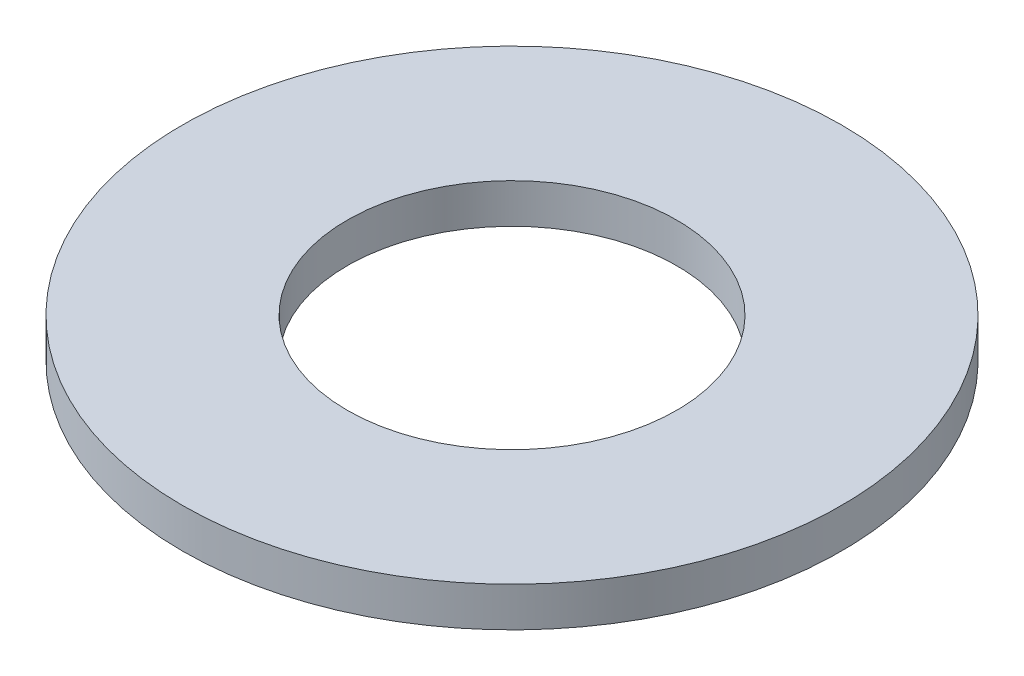
ISO-10303-21;
HEADER;
FILE_DESCRIPTION(('STEP AP214'),'2;1');
FILE_NAME('part.step','',(''),(''),'','','');
FILE_SCHEMA(('AUTOMOTIVE_DESIGN { 1 0 10303 214 1 1 1 1 }'));
ENDSEC;
DATA;
#1=APPLICATION_CONTEXT('core data for automotive mechanical design processes');
#2=APPLICATION_PROTOCOL_DEFINITION('international standard','automotive_design',2000,#1);
#3=PRODUCT_CONTEXT('',#1,'mechanical');
#4=PRODUCT('Part','Part','',(#3));
#5=PRODUCT_RELATED_PRODUCT_CATEGORY('part','',(#4));
#6=PRODUCT_DEFINITION_FORMATION('','',#4);
#7=PRODUCT_DEFINITION_CONTEXT('part definition',#1,'design');
#8=PRODUCT_DEFINITION('design','',#6,#7);
#9=PRODUCT_DEFINITION_SHAPE('','',#8);
#10=(LENGTH_UNIT() NAMED_UNIT(*) SI_UNIT(.MILLI.,.METRE.));
#11=(NAMED_UNIT(*) PLANE_ANGLE_UNIT() SI_UNIT($,.RADIAN.));
#12=(NAMED_UNIT(*) SI_UNIT($,.STERADIAN.) SOLID_ANGLE_UNIT());
#13=UNCERTAINTY_MEASURE_WITH_UNIT(LENGTH_MEASURE(1.E-05),#10,'distance_accuracy_value','');
#14=(GEOMETRIC_REPRESENTATION_CONTEXT(3) GLOBAL_UNCERTAINTY_ASSIGNED_CONTEXT((#13)) GLOBAL_UNIT_ASSIGNED_CONTEXT((#10,
#11,#12)) REPRESENTATION_CONTEXT('',''));
#15=CARTESIAN_POINT('',(0.,0.,0.));
#16=DIRECTION('',(0.,0.,1.));
#17=DIRECTION('',(1.,0.,0.));
#18=AXIS2_PLACEMENT_3D('',#15,#16,#17);
#19=CARTESIAN_POINT('',(0.,9.,0.));
#20=DIRECTION('',(0.,-1.,0.));
#21=DIRECTION('',(0.,0.,-1.));
#22=AXIS2_PLACEMENT_3D('',#19,#20,#21);
#23=CYLINDRICAL_SURFACE('',#22,75.);
#24=CARTESIAN_POINT('',(0.,9.,0.));
#25=DIRECTION('',(0.,1.,0.));
#26=DIRECTION('',(0.,0.,1.));
#27=AXIS2_PLACEMENT_3D('',#24,#25,#26);
#28=CIRCLE('',#27,75.);
#29=CARTESIAN_POINT('',(0.,9.,75.));
#30=VERTEX_POINT('',#29);
#31=EDGE_CURVE('E10',#30,#30,#28,.T.);
#32=ORIENTED_EDGE('',*,*,#31,.F.);
#33=EDGE_LOOP('',(#32));
#34=FACE_BOUND('',#33,.T.);
#35=CARTESIAN_POINT('',(0.,0.,0.));
#36=DIRECTION('',(0.,1.,0.));
#37=DIRECTION('',(0.,0.,1.));
#38=AXIS2_PLACEMENT_3D('',#35,#36,#37);
#39=CIRCLE('',#38,75.);
#40=CARTESIAN_POINT('',(0.,0.,75.));
#41=VERTEX_POINT('',#40);
#42=EDGE_CURVE('E37',#41,#41,#39,.T.);
#43=ORIENTED_EDGE('',*,*,#42,.T.);
#44=EDGE_LOOP('',(#43));
#45=FACE_BOUND('',#44,.T.);
#46=ADVANCED_FACE('F40',(#34,#45),#23,.T.);
#47=CARTESIAN_POINT('',(0.,9.,0.));
#48=DIRECTION('',(0.,1.,0.));
#49=DIRECTION('',(0.,0.,1.));
#50=AXIS2_PLACEMENT_3D('',#47,#48,#49);
#51=PLANE('',#50);
#52=CARTESIAN_POINT('',(0.,9.,0.));
#53=DIRECTION('',(0.,1.,0.));
#54=DIRECTION('',(0.,0.,1.));
#55=AXIS2_PLACEMENT_3D('',#52,#53,#54);
#56=CIRCLE('',#55,37.5);
#57=CARTESIAN_POINT('',(0.,9.,37.5));
#58=VERTEX_POINT('',#57);
#59=EDGE_CURVE('E50',#58,#58,#56,.T.);
#60=ORIENTED_EDGE('',*,*,#59,.F.);
#61=EDGE_LOOP('',(#60));
#62=FACE_BOUND('',#61,.T.);
#63=ORIENTED_EDGE('',*,*,#31,.T.);
#64=EDGE_LOOP('',(#63));
#65=FACE_BOUND('',#64,.T.);
#66=ADVANCED_FACE('F59',(#62,#65),#51,.T.);
#67=CARTESIAN_POINT('',(0.,0.,0.));
#68=DIRECTION('',(0.,1.,0.));
#69=DIRECTION('',(0.,0.,1.));
#70=AXIS2_PLACEMENT_3D('',#67,#68,#69);
#71=PLANE('',#70);
#72=CARTESIAN_POINT('',(0.,0.,0.));
#73=DIRECTION('',(0.,1.,0.));
#74=DIRECTION('',(0.,0.,1.));
#75=AXIS2_PLACEMENT_3D('',#72,#73,#74);
#76=CIRCLE('',#75,37.5);
#77=CARTESIAN_POINT('',(0.,0.,37.5));
#78=VERTEX_POINT('',#77);
#79=EDGE_CURVE('E47',#78,#78,#76,.T.);
#80=ORIENTED_EDGE('',*,*,#79,.T.);
#81=EDGE_LOOP('',(#80));
#82=FACE_BOUND('',#81,.T.);
#83=ORIENTED_EDGE('',*,*,#42,.F.);
#84=EDGE_LOOP('',(#83));
#85=FACE_BOUND('',#84,.T.);
#86=ADVANCED_FACE('F58',(#82,#85),#71,.F.);
#87=CARTESIAN_POINT('',(0.,9.,0.));
#88=DIRECTION('',(0.,-1.,0.));
#89=DIRECTION('',(0.,0.,-1.));
#90=AXIS2_PLACEMENT_3D('',#87,#88,#89);
#91=CYLINDRICAL_SURFACE('',#90,37.5);
#92=ORIENTED_EDGE('',*,*,#59,.T.);
#93=EDGE_LOOP('',(#92));
#94=FACE_BOUND('',#93,.T.);
#95=ORIENTED_EDGE('',*,*,#79,.F.);
#96=EDGE_LOOP('',(#95));
#97=FACE_BOUND('',#96,.T.);
#98=ADVANCED_FACE('F54',(#94,#97),#91,.F.);
#99=CLOSED_SHELL('',(#46,#66,#86,#98));
#100=MANIFOLD_SOLID_BREP('B2',#99);
#101=ADVANCED_BREP_SHAPE_REPRESENTATION('',(#18,#100),#14);
#102=SHAPE_DEFINITION_REPRESENTATION(#9,#101);
ENDSEC;
END-ISO-10303-21;
